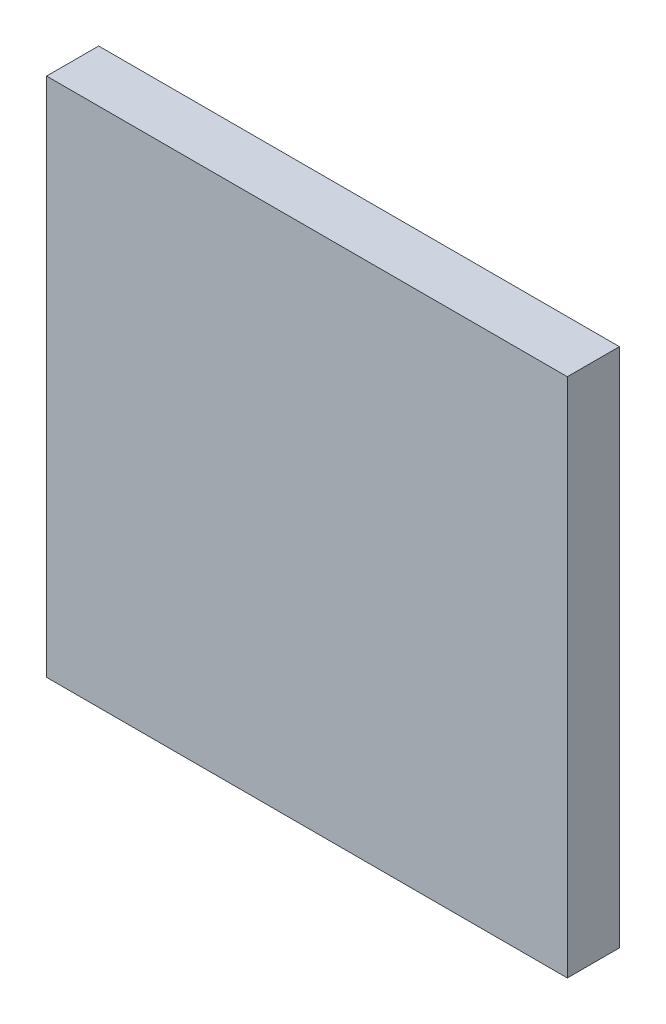
ISO-10303-21;
HEADER;
FILE_DESCRIPTION(('STEP AP214'),'2;1');
FILE_NAME('part.step','',(''),(''),'','','');
FILE_SCHEMA(('AUTOMOTIVE_DESIGN { 1 0 10303 214 1 1 1 1 }'));
ENDSEC;
DATA;
#1=APPLICATION_CONTEXT('core data for automotive mechanical design processes');
#2=APPLICATION_PROTOCOL_DEFINITION('international standard','automotive_design',2000,#1);
#3=PRODUCT_CONTEXT('',#1,'mechanical');
#4=PRODUCT('Part','Part','',(#3));
#5=PRODUCT_RELATED_PRODUCT_CATEGORY('part','',(#4));
#6=PRODUCT_DEFINITION_FORMATION('','',#4);
#7=PRODUCT_DEFINITION_CONTEXT('part definition',#1,'design');
#8=PRODUCT_DEFINITION('design','',#6,#7);
#9=PRODUCT_DEFINITION_SHAPE('','',#8);
#10=(LENGTH_UNIT() NAMED_UNIT(*) SI_UNIT(.MILLI.,.METRE.));
#11=(NAMED_UNIT(*) PLANE_ANGLE_UNIT() SI_UNIT($,.RADIAN.));
#12=(NAMED_UNIT(*) SI_UNIT($,.STERADIAN.) SOLID_ANGLE_UNIT());
#13=UNCERTAINTY_MEASURE_WITH_UNIT(LENGTH_MEASURE(1.E-05),#10,'distance_accuracy_value','');
#14=(GEOMETRIC_REPRESENTATION_CONTEXT(3) GLOBAL_UNCERTAINTY_ASSIGNED_CONTEXT((#13)) GLOBAL_UNIT_ASSIGNED_CONTEXT((#10,
#11,#12)) REPRESENTATION_CONTEXT('',''));
#15=CARTESIAN_POINT('',(0.,0.,0.));
#16=DIRECTION('',(0.,0.,1.));
#17=DIRECTION('',(1.,0.,0.));
#18=AXIS2_PLACEMENT_3D('',#15,#16,#17);
#19=CARTESIAN_POINT('',(0.,0.,10.));
#20=DIRECTION('',(1.,0.,0.));
#21=DIRECTION('',(0.,0.,-1.));
#22=AXIS2_PLACEMENT_3D('',#19,#20,#21);
#23=PLANE('',#22);
#24=DIRECTION('',(0.,-1.,0.));
#25=VECTOR('',#24,1.);
#26=CARTESIAN_POINT('',(0.,0.,0.));
#27=LINE('',#26,#25);
#28=CARTESIAN_POINT('',(0.,100.,0.));
#29=VERTEX_POINT('',#28);
#30=CARTESIAN_POINT('',(0.,0.,0.));
#31=VERTEX_POINT('',#30);
#32=EDGE_CURVE('E96',#29,#31,#27,.T.);
#33=ORIENTED_EDGE('',*,*,#32,.T.);
#34=DIRECTION('',(0.,0.,-1.));
#35=VECTOR('',#34,1.);
#36=CARTESIAN_POINT('',(0.,0.,10.));
#37=LINE('',#36,#35);
#38=CARTESIAN_POINT('',(0.,0.,10.));
#39=VERTEX_POINT('',#38);
#40=EDGE_CURVE('E11',#39,#31,#37,.T.);
#41=ORIENTED_EDGE('',*,*,#40,.F.);
#42=DIRECTION('',(0.,-1.,0.));
#43=VECTOR('',#42,1.);
#44=CARTESIAN_POINT('',(0.,0.,10.));
#45=LINE('',#44,#43);
#46=CARTESIAN_POINT('',(0.,100.,10.));
#47=VERTEX_POINT('',#46);
#48=EDGE_CURVE('E84',#47,#39,#45,.T.);
#49=ORIENTED_EDGE('',*,*,#48,.F.);
#50=DIRECTION('',(0.,0.,-1.));
#51=VECTOR('',#50,1.);
#52=CARTESIAN_POINT('',(0.,100.,10.));
#53=LINE('',#52,#51);
#54=EDGE_CURVE('E92',#47,#29,#53,.T.);
#55=ORIENTED_EDGE('',*,*,#54,.T.);
#56=EDGE_LOOP('',(#33,#41,#49,#55));
#57=FACE_BOUND('',#56,.T.);
#58=ADVANCED_FACE('F33',(#57),#23,.F.);
#59=CARTESIAN_POINT('',(0.,0.,10.));
#60=DIRECTION('',(0.,1.,0.));
#61=DIRECTION('',(0.,0.,1.));
#62=AXIS2_PLACEMENT_3D('',#59,#60,#61);
#63=PLANE('',#62);
#64=DIRECTION('',(1.,0.,0.));
#65=VECTOR('',#64,1.);
#66=CARTESIAN_POINT('',(0.,0.,0.));
#67=LINE('',#66,#65);
#68=CARTESIAN_POINT('',(100.,0.,0.));
#69=VERTEX_POINT('',#68);
#70=EDGE_CURVE('E88',#31,#69,#67,.T.);
#71=ORIENTED_EDGE('',*,*,#70,.T.);
#72=DIRECTION('',(0.,0.,-1.));
#73=VECTOR('',#72,1.);
#74=CARTESIAN_POINT('',(100.,0.,10.));
#75=LINE('',#74,#73);
#76=CARTESIAN_POINT('',(100.,0.,10.));
#77=VERTEX_POINT('',#76);
#78=EDGE_CURVE('E41',#77,#69,#75,.T.);
#79=ORIENTED_EDGE('',*,*,#78,.F.);
#80=DIRECTION('',(1.,0.,0.));
#81=VECTOR('',#80,1.);
#82=CARTESIAN_POINT('',(0.,0.,10.));
#83=LINE('',#82,#81);
#84=EDGE_CURVE('E79',#39,#77,#83,.T.);
#85=ORIENTED_EDGE('',*,*,#84,.F.);
#86=ORIENTED_EDGE('',*,*,#40,.T.);
#87=EDGE_LOOP('',(#71,#79,#85,#86));
#88=FACE_BOUND('',#87,.T.);
#89=ADVANCED_FACE('F87',(#88),#63,.F.);
#90=CARTESIAN_POINT('',(100.,0.,10.));
#91=DIRECTION('',(-1.,0.,0.));
#92=DIRECTION('',(0.,0.,1.));
#93=AXIS2_PLACEMENT_3D('',#90,#91,#92);
#94=PLANE('',#93);
#95=DIRECTION('',(0.,1.,0.));
#96=VECTOR('',#95,1.);
#97=CARTESIAN_POINT('',(100.,0.,0.));
#98=LINE('',#97,#96);
#99=CARTESIAN_POINT('',(100.,100.,0.));
#100=VERTEX_POINT('',#99);
#101=EDGE_CURVE('E66',#69,#100,#98,.T.);
#102=ORIENTED_EDGE('',*,*,#101,.T.);
#103=DIRECTION('',(0.,0.,-1.));
#104=VECTOR('',#103,1.);
#105=CARTESIAN_POINT('',(100.,100.,10.));
#106=LINE('',#105,#104);
#107=CARTESIAN_POINT('',(100.,100.,10.));
#108=VERTEX_POINT('',#107);
#109=EDGE_CURVE('E89',#108,#100,#106,.T.);
#110=ORIENTED_EDGE('',*,*,#109,.F.);
#111=DIRECTION('',(0.,1.,0.));
#112=VECTOR('',#111,1.);
#113=CARTESIAN_POINT('',(100.,0.,10.));
#114=LINE('',#113,#112);
#115=EDGE_CURVE('E82',#77,#108,#114,.T.);
#116=ORIENTED_EDGE('',*,*,#115,.F.);
#117=ORIENTED_EDGE('',*,*,#78,.T.);
#118=EDGE_LOOP('',(#102,#110,#116,#117));
#119=FACE_BOUND('',#118,.T.);
#120=ADVANCED_FACE('F90',(#119),#94,.F.);
#121=CARTESIAN_POINT('',(0.,100.,10.));
#122=DIRECTION('',(0.,-1.,0.));
#123=DIRECTION('',(0.,0.,-1.));
#124=AXIS2_PLACEMENT_3D('',#121,#122,#123);
#125=PLANE('',#124);
#126=DIRECTION('',(-1.,0.,0.));
#127=VECTOR('',#126,1.);
#128=CARTESIAN_POINT('',(0.,100.,0.));
#129=LINE('',#128,#127);
#130=EDGE_CURVE('E72',#100,#29,#129,.T.);
#131=ORIENTED_EDGE('',*,*,#130,.T.);
#132=ORIENTED_EDGE('',*,*,#54,.F.);
#133=DIRECTION('',(-1.,0.,0.));
#134=VECTOR('',#133,1.);
#135=CARTESIAN_POINT('',(0.,100.,10.));
#136=LINE('',#135,#134);
#137=EDGE_CURVE('E49',#108,#47,#136,.T.);
#138=ORIENTED_EDGE('',*,*,#137,.F.);
#139=ORIENTED_EDGE('',*,*,#109,.T.);
#140=EDGE_LOOP('',(#131,#132,#138,#139));
#141=FACE_BOUND('',#140,.T.);
#142=ADVANCED_FACE('F103',(#141),#125,.F.);
#143=CARTESIAN_POINT('',(0.,100.,10.));
#144=DIRECTION('',(0.,0.,-1.));
#145=DIRECTION('',(-1.,0.,0.));
#146=AXIS2_PLACEMENT_3D('',#143,#144,#145);
#147=PLANE('',#146);
#148=ORIENTED_EDGE('',*,*,#48,.T.);
#149=ORIENTED_EDGE('',*,*,#84,.T.);
#150=ORIENTED_EDGE('',*,*,#115,.T.);
#151=ORIENTED_EDGE('',*,*,#137,.T.);
#152=EDGE_LOOP('',(#148,#149,#150,#151));
#153=FACE_BOUND('',#152,.T.);
#154=ADVANCED_FACE('F80',(#153),#147,.F.);
#155=CARTESIAN_POINT('',(0.,100.,0.));
#156=DIRECTION('',(0.,0.,-1.));
#157=DIRECTION('',(-1.,0.,0.));
#158=AXIS2_PLACEMENT_3D('',#155,#156,#157);
#159=PLANE('',#158);
#160=ORIENTED_EDGE('',*,*,#32,.F.);
#161=ORIENTED_EDGE('',*,*,#130,.F.);
#162=ORIENTED_EDGE('',*,*,#101,.F.);
#163=ORIENTED_EDGE('',*,*,#70,.F.);
#164=EDGE_LOOP('',(#160,#161,#162,#163));
#165=FACE_BOUND('',#164,.T.);
#166=ADVANCED_FACE('F106',(#165),#159,.T.);
#167=CLOSED_SHELL('',(#58,#89,#120,#142,#154,#166));
#168=MANIFOLD_SOLID_BREP('B2',#167);
#169=ADVANCED_BREP_SHAPE_REPRESENTATION('',(#18,#168),#14);
#170=SHAPE_DEFINITION_REPRESENTATION(#9,#169);
ENDSEC;
END-ISO-10303-21;
